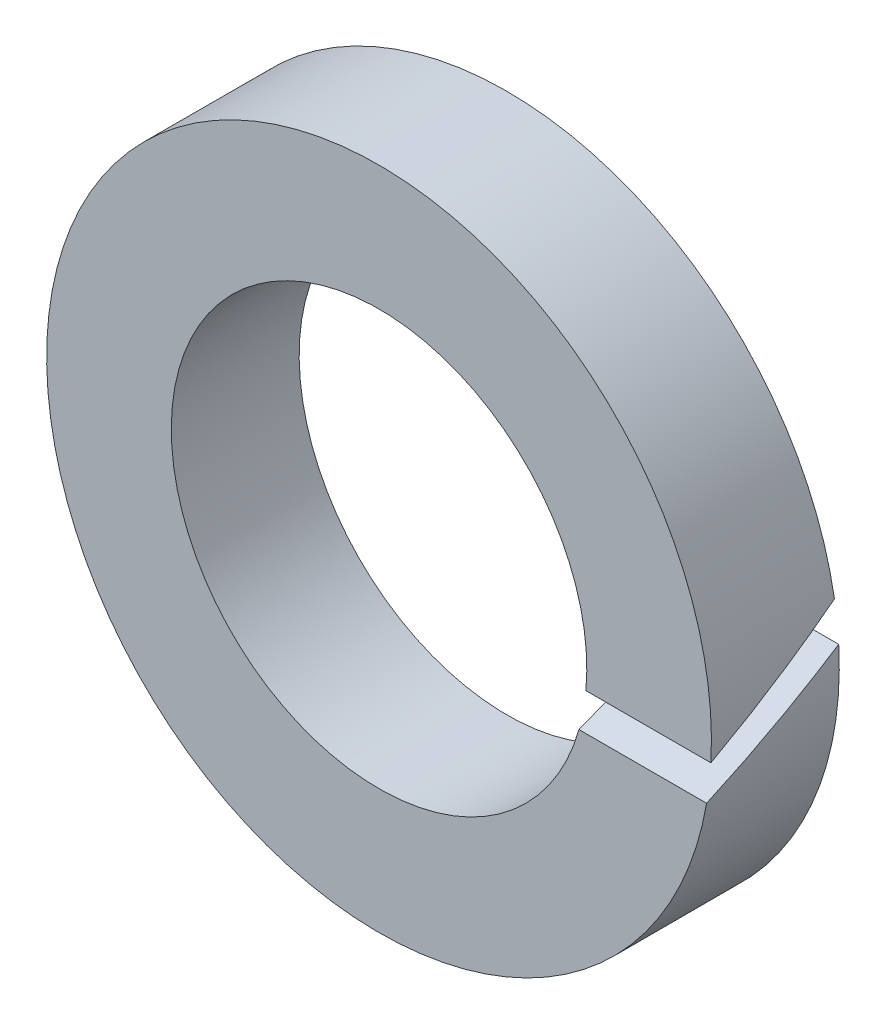
ISO-10303-21;
HEADER;
FILE_DESCRIPTION(('STEP AP214'),'2;1');
FILE_NAME('part.step','',(''),(''),'','','');
FILE_SCHEMA(('AUTOMOTIVE_DESIGN { 1 0 10303 214 1 1 1 1 }'));
ENDSEC;
DATA;
#1=APPLICATION_CONTEXT('core data for automotive mechanical design processes');
#2=APPLICATION_PROTOCOL_DEFINITION('international standard','automotive_design',2000,#1);
#3=PRODUCT_CONTEXT('',#1,'mechanical');
#4=PRODUCT('Part','Part','',(#3));
#5=PRODUCT_RELATED_PRODUCT_CATEGORY('part','',(#4));
#6=PRODUCT_DEFINITION_FORMATION('','',#4);
#7=PRODUCT_DEFINITION_CONTEXT('part definition',#1,'design');
#8=PRODUCT_DEFINITION('design','',#6,#7);
#9=PRODUCT_DEFINITION_SHAPE('','',#8);
#10=(LENGTH_UNIT() NAMED_UNIT(*) SI_UNIT(.MILLI.,.METRE.));
#11=(NAMED_UNIT(*) PLANE_ANGLE_UNIT() SI_UNIT($,.RADIAN.));
#12=(NAMED_UNIT(*) SI_UNIT($,.STERADIAN.) SOLID_ANGLE_UNIT());
#13=UNCERTAINTY_MEASURE_WITH_UNIT(LENGTH_MEASURE(1.E-05),#10,'distance_accuracy_value','');
#14=(GEOMETRIC_REPRESENTATION_CONTEXT(3) GLOBAL_UNCERTAINTY_ASSIGNED_CONTEXT((#13)) GLOBAL_UNIT_ASSIGNED_CONTEXT((#10,
#11,#12)) REPRESENTATION_CONTEXT('',''));
#15=CARTESIAN_POINT('',(0.,0.,0.));
#16=DIRECTION('',(0.,0.,1.));
#17=DIRECTION('',(1.,0.,0.));
#18=AXIS2_PLACEMENT_3D('',#15,#16,#17);
#19=CARTESIAN_POINT('',(0.,0.,2.));
#20=DIRECTION('',(0.,0.,1.));
#21=DIRECTION('',(1.,0.,0.));
#22=AXIS2_PLACEMENT_3D('',#19,#20,#21);
#23=PLANE('',#22);
#24=CARTESIAN_POINT('',(0.,0.,2.));
#25=DIRECTION('',(0.,0.,1.));
#26=DIRECTION('',(1.,0.,0.));
#27=AXIS2_PLACEMENT_3D('',#24,#25,#26);
#28=CIRCLE('',#27,5.2);
#29=CARTESIAN_POINT('',(5.19118452304954,-0.302660284231131,2.));
#30=VERTEX_POINT('',#29);
#31=CARTESIAN_POINT('',(5.12429988960151,-0.88405352859993,2.));
#32=VERTEX_POINT('',#31);
#33=EDGE_CURVE('E78',#30,#32,#28,.T.);
#34=ORIENTED_EDGE('',*,*,#33,.T.);
#35=DIRECTION('',(-1.,0.,0.));
#36=VECTOR('',#35,1.);
#37=CARTESIAN_POINT('',(5.19999999999999,-0.884053528599937,2.));
#38=LINE('',#37,#36);
#39=CARTESIAN_POINT('',(3.12745093623701,-0.884053528599944,2.));
#40=VERTEX_POINT('',#39);
#41=EDGE_CURVE('E80',#32,#40,#38,.T.);
#42=ORIENTED_EDGE('',*,*,#41,.T.);
#43=CARTESIAN_POINT('',(0.,0.,2.));
#44=DIRECTION('',(0.,0.,1.));
#45=DIRECTION('',(1.,0.,0.));
#46=AXIS2_PLACEMENT_3D('',#43,#44,#45);
#47=CIRCLE('',#46,3.25);
#48=CARTESIAN_POINT('',(3.23587650449598,-0.302660284231086,2.));
#49=VERTEX_POINT('',#48);
#50=EDGE_CURVE('E90',#49,#40,#47,.T.);
#51=ORIENTED_EDGE('',*,*,#50,.F.);
#52=DIRECTION('',(-1.,0.,0.));
#53=VECTOR('',#52,1.);
#54=CARTESIAN_POINT('',(5.20000000000001,-0.302660284231093,2.));
#55=LINE('',#54,#53);
#56=EDGE_CURVE('E54',#30,#49,#55,.T.);
#57=ORIENTED_EDGE('',*,*,#56,.F.);
#58=EDGE_LOOP('',(#34,#42,#51,#57));
#59=FACE_BOUND('',#58,.T.);
#60=ADVANCED_FACE('F32',(#59),#23,.T.);
#61=CARTESIAN_POINT('',(0.,0.,0.));
#62=DIRECTION('',(0.,0.,1.));
#63=DIRECTION('',(1.,0.,0.));
#64=AXIS2_PLACEMENT_3D('',#61,#62,#63);
#65=PLANE('',#64);
#66=DIRECTION('',(-1.,0.,0.));
#67=VECTOR('',#66,1.);
#68=CARTESIAN_POINT('',(5.19999999999999,0.302660284231052,0.));
#69=LINE('',#68,#67);
#70=CARTESIAN_POINT('',(5.19118452304954,0.302660284231072,0.));
#71=VERTEX_POINT('',#70);
#72=CARTESIAN_POINT('',(3.23587650449598,0.302660284231066,0.));
#73=VERTEX_POINT('',#72);
#74=EDGE_CURVE('E47',#71,#73,#69,.T.);
#75=ORIENTED_EDGE('',*,*,#74,.F.);
#76=CARTESIAN_POINT('',(0.,0.,0.));
#77=DIRECTION('',(0.,0.,1.));
#78=DIRECTION('',(1.,0.,0.));
#79=AXIS2_PLACEMENT_3D('',#76,#77,#78);
#80=CIRCLE('',#79,5.2);
#81=CARTESIAN_POINT('',(5.1242998896015,0.884053528599923,0.));
#82=VERTEX_POINT('',#81);
#83=EDGE_CURVE('E76',#82,#71,#80,.T.);
#84=ORIENTED_EDGE('',*,*,#83,.F.);
#85=DIRECTION('',(-1.,0.,0.));
#86=VECTOR('',#85,1.);
#87=CARTESIAN_POINT('',(5.19999999999999,0.884053528599958,0.));
#88=LINE('',#87,#86);
#89=CARTESIAN_POINT('',(3.12745093623703,0.884053528599951,0.));
#90=VERTEX_POINT('',#89);
#91=EDGE_CURVE('E83',#82,#90,#88,.T.);
#92=ORIENTED_EDGE('',*,*,#91,.T.);
#93=CARTESIAN_POINT('',(0.,0.,0.));
#94=DIRECTION('',(0.,0.,1.));
#95=DIRECTION('',(1.,0.,0.));
#96=AXIS2_PLACEMENT_3D('',#93,#94,#95);
#97=CIRCLE('',#96,3.25);
#98=EDGE_CURVE('E94',#90,#73,#97,.T.);
#99=ORIENTED_EDGE('',*,*,#98,.T.);
#100=EDGE_LOOP('',(#75,#84,#92,#99));
#101=FACE_BOUND('',#100,.T.);
#102=ADVANCED_FACE('F89',(#101),#65,.F.);
#103=CARTESIAN_POINT('',(0.,0.,2.));
#104=DIRECTION('',(0.,0.,-1.));
#105=DIRECTION('',(-1.,0.,0.));
#106=AXIS2_PLACEMENT_3D('',#103,#104,#105);
#107=CYLINDRICAL_SURFACE('',#106,5.2);
#108=CARTESIAN_POINT('',(0.,0.,0.51008133714911));
#109=DIRECTION('',(0.,0.860003112940855,0.510288786602295));
#110=DIRECTION('',(0.,0.510288786602297,-0.860003112940853));
#111=AXIS2_PLACEMENT_3D('',#108,#109,#110);
#112=ELLIPSE('',#111,10.1903081872985,5.2);
#113=EDGE_CURVE('E79',#32,#71,#112,.T.);
#114=ORIENTED_EDGE('',*,*,#113,.F.);
#115=ORIENTED_EDGE('',*,*,#33,.F.);
#116=CARTESIAN_POINT('',(0.,0.,1.48991866285089));
#117=DIRECTION('',(0.,0.860003112940855,0.510288786602295));
#118=DIRECTION('',(0.,0.510288786602297,-0.860003112940853));
#119=AXIS2_PLACEMENT_3D('',#116,#117,#118);
#120=ELLIPSE('',#119,10.1903081872985,5.2);
#121=EDGE_CURVE('E72',#30,#82,#120,.T.);
#122=ORIENTED_EDGE('',*,*,#121,.T.);
#123=ORIENTED_EDGE('',*,*,#83,.T.);
#124=EDGE_LOOP('',(#114,#115,#122,#123));
#125=FACE_BOUND('',#124,.T.);
#126=ADVANCED_FACE('F34',(#125),#107,.T.);
#127=CARTESIAN_POINT('',(0.,0.,2.));
#128=DIRECTION('',(0.,0.,-1.));
#129=DIRECTION('',(-1.,0.,0.));
#130=AXIS2_PLACEMENT_3D('',#127,#128,#129);
#131=CYLINDRICAL_SURFACE('',#130,3.25);
#132=ORIENTED_EDGE('',*,*,#50,.T.);
#133=CARTESIAN_POINT('',(0.,0.,0.51008133714911));
#134=DIRECTION('',(0.,0.860003112940855,0.510288786602295));
#135=DIRECTION('',(0.,0.510288786602297,-0.860003112940853));
#136=AXIS2_PLACEMENT_3D('',#133,#134,#135);
#137=ELLIPSE('',#136,6.36894261706158,3.25);
#138=EDGE_CURVE('E11',#40,#73,#137,.T.);
#139=ORIENTED_EDGE('',*,*,#138,.T.);
#140=ORIENTED_EDGE('',*,*,#98,.F.);
#141=CARTESIAN_POINT('',(0.,0.,1.48991866285089));
#142=DIRECTION('',(0.,0.860003112940855,0.510288786602295));
#143=DIRECTION('',(0.,0.510288786602297,-0.860003112940853));
#144=AXIS2_PLACEMENT_3D('',#141,#142,#143);
#145=ELLIPSE('',#144,6.36894261706158,3.25);
#146=EDGE_CURVE('E40',#49,#90,#145,.T.);
#147=ORIENTED_EDGE('',*,*,#146,.F.);
#148=EDGE_LOOP('',(#132,#139,#140,#147));
#149=FACE_BOUND('',#148,.T.);
#150=ADVANCED_FACE('F105',(#149),#131,.F.);
#151=CARTESIAN_POINT('',(5.20000000000001,-0.302660284231093,2.));
#152=DIRECTION('',(0.,0.860003112940855,0.510288786602295));
#153=DIRECTION('',(0.,-0.510288786602297,0.860003112940853));
#154=AXIS2_PLACEMENT_3D('',#151,#152,#153);
#155=PLANE('',#154);
#156=ORIENTED_EDGE('',*,*,#56,.T.);
#157=ORIENTED_EDGE('',*,*,#146,.T.);
#158=ORIENTED_EDGE('',*,*,#91,.F.);
#159=ORIENTED_EDGE('',*,*,#121,.F.);
#160=EDGE_LOOP('',(#156,#157,#158,#159));
#161=FACE_BOUND('',#160,.T.);
#162=ADVANCED_FACE('F84',(#161),#155,.F.);
#163=CARTESIAN_POINT('',(5.19999999999999,-0.884053528599937,2.));
#164=DIRECTION('',(0.,0.860003112940855,0.510288786602295));
#165=DIRECTION('',(0.,-0.510288786602297,0.860003112940853));
#166=AXIS2_PLACEMENT_3D('',#163,#164,#165);
#167=PLANE('',#166);
#168=ORIENTED_EDGE('',*,*,#113,.T.);
#169=ORIENTED_EDGE('',*,*,#74,.T.);
#170=ORIENTED_EDGE('',*,*,#138,.F.);
#171=ORIENTED_EDGE('',*,*,#41,.F.);
#172=EDGE_LOOP('',(#168,#169,#170,#171));
#173=FACE_BOUND('',#172,.T.);
#174=ADVANCED_FACE('F106',(#173),#167,.T.);
#175=CLOSED_SHELL('',(#60,#102,#126,#150,#162,#174));
#176=MANIFOLD_SOLID_BREP('B2',#175);
#177=ADVANCED_BREP_SHAPE_REPRESENTATION('',(#18,#176),#14);
#178=SHAPE_DEFINITION_REPRESENTATION(#9,#177);
ENDSEC;
END-ISO-10303-21;
